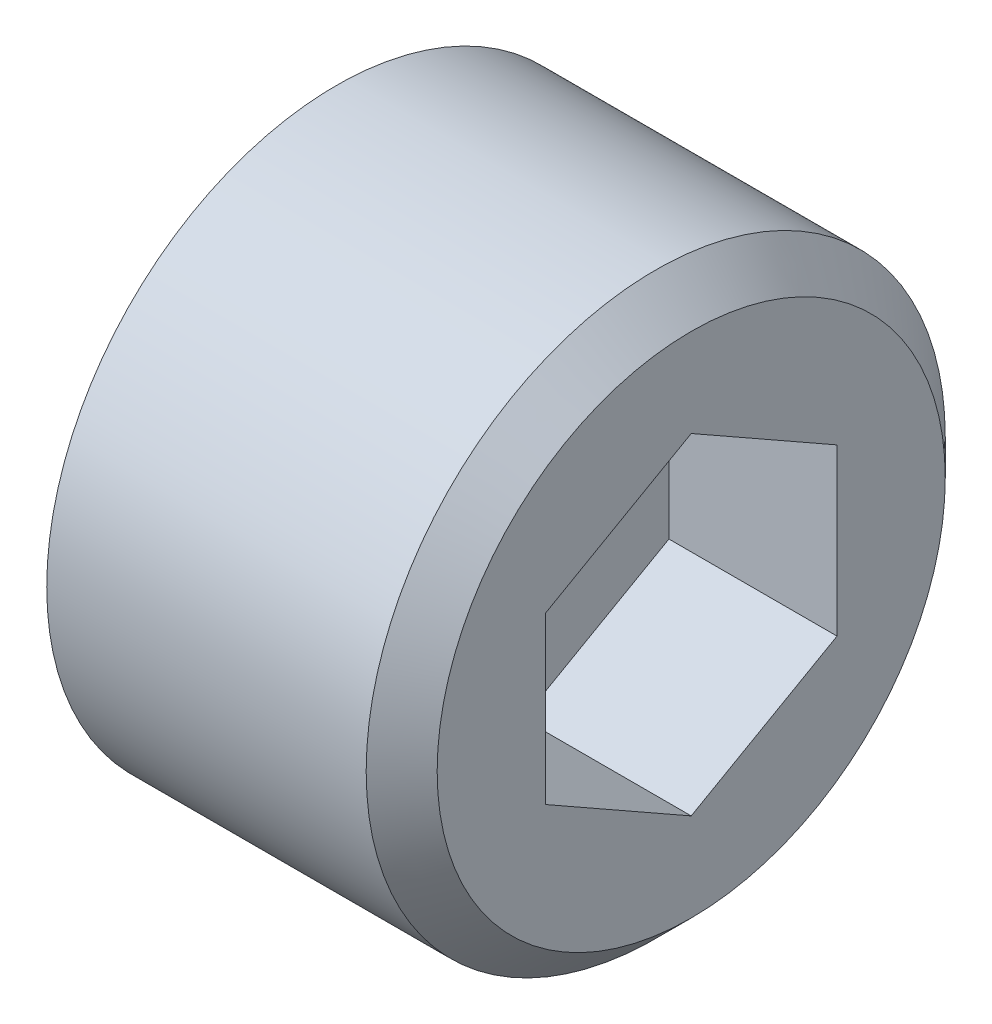
ISO-10303-21;
HEADER;
FILE_DESCRIPTION(('STEP AP214'),'2;1');
FILE_NAME('part.step','',(''),(''),'','','');
FILE_SCHEMA(('AUTOMOTIVE_DESIGN { 1 0 10303 214 1 1 1 1 }'));
ENDSEC;
DATA;
#1=APPLICATION_CONTEXT('core data for automotive mechanical design processes');
#2=APPLICATION_PROTOCOL_DEFINITION('international standard','automotive_design',2000,#1);
#3=PRODUCT_CONTEXT('',#1,'mechanical');
#4=PRODUCT('Part','Part','',(#3));
#5=PRODUCT_RELATED_PRODUCT_CATEGORY('part','',(#4));
#6=PRODUCT_DEFINITION_FORMATION('','',#4);
#7=PRODUCT_DEFINITION_CONTEXT('part definition',#1,'design');
#8=PRODUCT_DEFINITION('design','',#6,#7);
#9=PRODUCT_DEFINITION_SHAPE('','',#8);
#10=(LENGTH_UNIT() NAMED_UNIT(*) SI_UNIT(.MILLI.,.METRE.));
#11=(NAMED_UNIT(*) PLANE_ANGLE_UNIT() SI_UNIT($,.RADIAN.));
#12=(NAMED_UNIT(*) SI_UNIT($,.STERADIAN.) SOLID_ANGLE_UNIT());
#13=UNCERTAINTY_MEASURE_WITH_UNIT(LENGTH_MEASURE(1.E-05),#10,'distance_accuracy_value','');
#14=(GEOMETRIC_REPRESENTATION_CONTEXT(3) GLOBAL_UNCERTAINTY_ASSIGNED_CONTEXT((#13)) GLOBAL_UNIT_ASSIGNED_CONTEXT((#10,
#11,#12)) REPRESENTATION_CONTEXT('',''));
#15=CARTESIAN_POINT('',(0.,0.,0.));
#16=DIRECTION('',(0.,0.,1.));
#17=DIRECTION('',(1.,0.,0.));
#18=AXIS2_PLACEMENT_3D('',#15,#16,#17);
#19=CARTESIAN_POINT('',(698.265305948307,491.9201871,53.4669999999995));
#20=DIRECTION('',(1.,0.,0.));
#21=DIRECTION('',(0.,0.,-1.));
#22=AXIS2_PLACEMENT_3D('',#19,#20,#21);
#23=PLANE('',#22);
#24=DIRECTION('',(0.,0.493693899375207,0.869635747724128));
#25=VECTOR('',#24,1.);
#26=CARTESIAN_POINT('',(698.265305948307,493.045906050237,51.4840598780827));
#27=LINE('',#26,#25);
#28=CARTESIAN_POINT('',(698.265305948307,493.045906050237,51.4840598780827));
#29=VERTEX_POINT('',#28);
#30=CARTESIAN_POINT('',(698.265305948307,494.171625000473,53.4669999999994));
#31=VERTEX_POINT('',#30);
#32=EDGE_CURVE('E81',#29,#31,#27,.T.);
#33=ORIENTED_EDGE('',*,*,#32,.T.);
#34=DIRECTION('',(0.,-0.493693899375212,0.869635747724125));
#35=VECTOR('',#34,1.);
#36=CARTESIAN_POINT('',(698.265305948307,494.171625000473,53.4669999999995));
#37=LINE('',#36,#35);
#38=CARTESIAN_POINT('',(698.265305948307,493.045906050236,55.4499401219164));
#39=VERTEX_POINT('',#38);
#40=EDGE_CURVE('E65',#31,#39,#37,.T.);
#41=ORIENTED_EDGE('',*,*,#40,.T.);
#42=DIRECTION('',(0.,1.,0.));
#43=VECTOR('',#42,1.);
#44=CARTESIAN_POINT('',(698.265305948307,493.045906050237,55.4499401219165));
#45=LINE('',#44,#43);
#46=CARTESIAN_POINT('',(698.265305948307,490.794468149764,55.4499401219165));
#47=VERTEX_POINT('',#46);
#48=EDGE_CURVE('E70',#39,#47,#45,.F.);
#49=ORIENTED_EDGE('',*,*,#48,.T.);
#50=DIRECTION('',(0.,-0.493693899375212,-0.869635747724125));
#51=VECTOR('',#50,1.);
#52=CARTESIAN_POINT('',(698.265305948307,490.794468149764,55.4499401219165));
#53=LINE('',#52,#51);
#54=CARTESIAN_POINT('',(698.265305948307,489.668749199525,53.4669999999993));
#55=VERTEX_POINT('',#54);
#56=EDGE_CURVE('E104',#47,#55,#53,.T.);
#57=ORIENTED_EDGE('',*,*,#56,.T.);
#58=DIRECTION('',(0.,0.493693899375192,-0.869635747724136));
#59=VECTOR('',#58,1.);
#60=CARTESIAN_POINT('',(698.265305948307,489.668749199524,53.4669999999995));
#61=LINE('',#60,#59);
#62=CARTESIAN_POINT('',(698.265305948307,490.794468149763,51.4840598780825));
#63=VERTEX_POINT('',#62);
#64=EDGE_CURVE('E99',#55,#63,#61,.T.);
#65=ORIENTED_EDGE('',*,*,#64,.T.);
#66=DIRECTION('',(0.,1.,0.));
#67=VECTOR('',#66,1.);
#68=CARTESIAN_POINT('',(698.265305948307,490.794468149764,51.4840598780827));
#69=LINE('',#68,#67);
#70=EDGE_CURVE('E95',#63,#29,#69,.T.);
#71=ORIENTED_EDGE('',*,*,#70,.T.);
#72=EDGE_LOOP('',(#33,#41,#49,#57,#65,#71));
#73=FACE_BOUND('',#72,.T.);
#74=ADVANCED_FACE('F16',(#73),#23,.T.);
#75=CARTESIAN_POINT('',(700.551305948307,493.045906050237,55.4499401219165));
#76=DIRECTION('',(0.,0.,1.));
#77=DIRECTION('',(1.,0.,0.));
#78=AXIS2_PLACEMENT_3D('',#75,#76,#77);
#79=PLANE('',#78);
#80=DIRECTION('',(1.,0.,0.));
#81=VECTOR('',#80,1.);
#82=CARTESIAN_POINT('',(700.551305948307,493.045906050236,55.4499401219162));
#83=LINE('',#82,#81);
#84=CARTESIAN_POINT('',(700.551305948307,493.045906050236,55.4499401219164));
#85=VERTEX_POINT('',#84);
#86=EDGE_CURVE('E72',#39,#85,#83,.T.);
#87=ORIENTED_EDGE('',*,*,#86,.T.);
#88=DIRECTION('',(0.,1.,0.));
#89=VECTOR('',#88,1.);
#90=CARTESIAN_POINT('',(700.551305948307,491.9201871,55.4499401219165));
#91=LINE('',#90,#89);
#92=CARTESIAN_POINT('',(700.551305948307,490.794468149764,55.4499401219165));
#93=VERTEX_POINT('',#92);
#94=EDGE_CURVE('E106',#93,#85,#91,.T.);
#95=ORIENTED_EDGE('',*,*,#94,.F.);
#96=DIRECTION('',(1.,0.,0.));
#97=VECTOR('',#96,1.);
#98=CARTESIAN_POINT('',(700.551305948307,490.794468149764,55.4499401219165));
#99=LINE('',#98,#97);
#100=EDGE_CURVE('E75',#93,#47,#99,.F.);
#101=ORIENTED_EDGE('',*,*,#100,.T.);
#102=ORIENTED_EDGE('',*,*,#48,.F.);
#103=EDGE_LOOP('',(#87,#95,#101,#102));
#104=FACE_BOUND('',#103,.T.);
#105=ADVANCED_FACE('F71',(#104),#79,.F.);
#106=CARTESIAN_POINT('',(700.551305948307,494.171625000473,53.4669999999995));
#107=DIRECTION('',(0.,0.869635747724125,0.493693899375212));
#108=DIRECTION('',(0.,-0.493693899375212,0.869635747724125));
#109=AXIS2_PLACEMENT_3D('',#106,#107,#108);
#110=PLANE('',#109);
#111=DIRECTION('',(1.,0.,0.));
#112=VECTOR('',#111,1.);
#113=CARTESIAN_POINT('',(700.551305948307,494.171625000474,53.4669999999993));
#114=LINE('',#113,#112);
#115=CARTESIAN_POINT('',(700.551305948307,494.171625000473,53.4669999999994));
#116=VERTEX_POINT('',#115);
#117=EDGE_CURVE('E83',#31,#116,#114,.T.);
#118=ORIENTED_EDGE('',*,*,#117,.T.);
#119=DIRECTION('',(0.,0.49369389937499,-0.869635747724251));
#120=VECTOR('',#119,1.);
#121=CARTESIAN_POINT('',(700.551305948307,493.045906050237,55.4499401219165));
#122=LINE('',#121,#120);
#123=EDGE_CURVE('E87',#85,#116,#122,.T.);
#124=ORIENTED_EDGE('',*,*,#123,.F.);
#125=ORIENTED_EDGE('',*,*,#86,.F.);
#126=ORIENTED_EDGE('',*,*,#40,.F.);
#127=EDGE_LOOP('',(#118,#124,#125,#126));
#128=FACE_BOUND('',#127,.T.);
#129=ADVANCED_FACE('F85',(#128),#110,.F.);
#130=CARTESIAN_POINT('',(700.551305948307,493.045906050237,51.4840598780827));
#131=DIRECTION('',(0.,0.869635747724128,-0.493693899375207));
#132=DIRECTION('',(0.,0.493693899375207,0.869635747724128));
#133=AXIS2_PLACEMENT_3D('',#130,#131,#132);
#134=PLANE('',#133);
#135=DIRECTION('',(-1.,0.,0.));
#136=VECTOR('',#135,1.);
#137=CARTESIAN_POINT('',(700.551305948307,493.045906050237,51.4840598780827));
#138=LINE('',#137,#136);
#139=CARTESIAN_POINT('',(700.551305948307,493.045906050237,51.4840598780827));
#140=VERTEX_POINT('',#139);
#141=EDGE_CURVE('E93',#29,#140,#138,.F.);
#142=ORIENTED_EDGE('',*,*,#141,.T.);
#143=DIRECTION('',(0.,-0.493693899375037,-0.869635747724224));
#144=VECTOR('',#143,1.);
#145=CARTESIAN_POINT('',(700.551305948307,494.171625000473,53.4669999999995));
#146=LINE('',#145,#144);
#147=EDGE_CURVE('E109',#116,#140,#146,.T.);
#148=ORIENTED_EDGE('',*,*,#147,.F.);
#149=ORIENTED_EDGE('',*,*,#117,.F.);
#150=ORIENTED_EDGE('',*,*,#32,.F.);
#151=EDGE_LOOP('',(#142,#148,#149,#150));
#152=FACE_BOUND('',#151,.T.);
#153=ADVANCED_FACE('F191',(#152),#134,.F.);
#154=CARTESIAN_POINT('',(700.551305948307,490.794468149764,51.4840598780827));
#155=DIRECTION('',(0.,0.,-1.));
#156=DIRECTION('',(-1.,0.,0.));
#157=AXIS2_PLACEMENT_3D('',#154,#155,#156);
#158=PLANE('',#157);
#159=DIRECTION('',(1.,0.,0.));
#160=VECTOR('',#159,1.);
#161=CARTESIAN_POINT('',(700.551305948307,490.794468149762,51.4840598780819));
#162=LINE('',#161,#160);
#163=CARTESIAN_POINT('',(700.551305948307,490.794468149763,51.4840598780825));
#164=VERTEX_POINT('',#163);
#165=EDGE_CURVE('E97',#63,#164,#162,.T.);
#166=ORIENTED_EDGE('',*,*,#165,.T.);
#167=DIRECTION('',(0.,1.,0.));
#168=VECTOR('',#167,1.);
#169=CARTESIAN_POINT('',(700.551305948307,491.9201871,51.4840598780827));
#170=LINE('',#169,#168);
#171=EDGE_CURVE('E112',#140,#164,#170,.F.);
#172=ORIENTED_EDGE('',*,*,#171,.F.);
#173=ORIENTED_EDGE('',*,*,#141,.F.);
#174=ORIENTED_EDGE('',*,*,#70,.F.);
#175=EDGE_LOOP('',(#166,#172,#173,#174));
#176=FACE_BOUND('',#175,.T.);
#177=ADVANCED_FACE('F138',(#176),#158,.F.);
#178=CARTESIAN_POINT('',(700.551305948307,489.668749199524,53.4669999999995));
#179=DIRECTION('',(0.,-0.869635747724136,-0.493693899375192));
#180=DIRECTION('',(0.,0.493693899375192,-0.869635747724136));
#181=AXIS2_PLACEMENT_3D('',#178,#179,#180);
#182=PLANE('',#181);
#183=DIRECTION('',(1.,0.,0.));
#184=VECTOR('',#183,1.);
#185=CARTESIAN_POINT('',(700.551305948307,489.668749199526,53.4669999999987));
#186=LINE('',#185,#184);
#187=CARTESIAN_POINT('',(700.551305948307,489.668749199525,53.4669999999993));
#188=VERTEX_POINT('',#187);
#189=EDGE_CURVE('E33',#55,#188,#186,.T.);
#190=ORIENTED_EDGE('',*,*,#189,.T.);
#191=DIRECTION('',(0.,-0.493693899375865,0.869635747723754));
#192=VECTOR('',#191,1.);
#193=CARTESIAN_POINT('',(700.551305948307,490.794468149764,51.4840598780827));
#194=LINE('',#193,#192);
#195=EDGE_CURVE('E115',#164,#188,#194,.T.);
#196=ORIENTED_EDGE('',*,*,#195,.F.);
#197=ORIENTED_EDGE('',*,*,#165,.F.);
#198=ORIENTED_EDGE('',*,*,#64,.F.);
#199=EDGE_LOOP('',(#190,#196,#197,#198));
#200=FACE_BOUND('',#199,.T.);
#201=ADVANCED_FACE('F136',(#200),#182,.F.);
#202=CARTESIAN_POINT('',(700.551305948307,490.794468149764,55.4499401219165));
#203=DIRECTION('',(0.,-0.869635747724125,0.493693899375212));
#204=DIRECTION('',(0.,-0.493693899375212,-0.869635747724125));
#205=AXIS2_PLACEMENT_3D('',#202,#203,#204);
#206=PLANE('',#205);
#207=ORIENTED_EDGE('',*,*,#100,.F.);
#208=DIRECTION('',(0.,0.493693899375818,0.869635747723781));
#209=VECTOR('',#208,1.);
#210=CARTESIAN_POINT('',(700.551305948307,489.668749199524,53.4669999999995));
#211=LINE('',#210,#209);
#212=EDGE_CURVE('E118',#188,#93,#211,.T.);
#213=ORIENTED_EDGE('',*,*,#212,.F.);
#214=ORIENTED_EDGE('',*,*,#189,.F.);
#215=ORIENTED_EDGE('',*,*,#56,.F.);
#216=EDGE_LOOP('',(#207,#213,#214,#215));
#217=FACE_BOUND('',#216,.T.);
#218=ADVANCED_FACE('F132',(#217),#206,.F.);
#219=CARTESIAN_POINT('',(700.551305948307,491.9201871,53.4669999999995));
#220=DIRECTION('',(1.,0.,0.));
#221=DIRECTION('',(0.,0.,-1.));
#222=AXIS2_PLACEMENT_3D('',#219,#220,#221);
#223=PLANE('',#222);
#224=CARTESIAN_POINT('',(700.551305948295,491.9201871,53.4669999999995));
#225=DIRECTION('',(-1.,0.,0.));
#226=DIRECTION('',(0.,0.,1.));
#227=AXIS2_PLACEMENT_3D('',#224,#225,#226);
#228=CIRCLE('',#227,3.45440000001696);
#229=CARTESIAN_POINT('',(700.551305948295,491.9201871,56.9214000000164));
#230=VERTEX_POINT('',#229);
#231=EDGE_CURVE('E19',#230,#230,#228,.T.);
#232=ORIENTED_EDGE('',*,*,#231,.F.);
#233=EDGE_LOOP('',(#232));
#234=FACE_BOUND('',#233,.T.);
#235=ORIENTED_EDGE('',*,*,#195,.T.);
#236=ORIENTED_EDGE('',*,*,#212,.T.);
#237=ORIENTED_EDGE('',*,*,#94,.T.);
#238=ORIENTED_EDGE('',*,*,#123,.T.);
#239=ORIENTED_EDGE('',*,*,#147,.T.);
#240=ORIENTED_EDGE('',*,*,#171,.T.);
#241=EDGE_LOOP('',(#235,#236,#237,#238,#239,#240));
#242=FACE_BOUND('',#241,.T.);
#243=ADVANCED_FACE('F129',(#234,#242),#223,.T.);
#244=CARTESIAN_POINT('',(700.068705948411,491.9201871,53.4669999999995));
#245=DIRECTION('',(-1.,0.,0.));
#246=DIRECTION('',(0.,0.,1.));
#247=AXIS2_PLACEMENT_3D('',#244,#245,#246);
#248=CONICAL_SURFACE('',#247,3.93699999990127,0.785398163397448);
#249=CARTESIAN_POINT('',(700.068705948307,491.9201871,53.4669999999995));
#250=DIRECTION('',(1.,0.,0.));
#251=DIRECTION('',(0.,0.,-1.));
#252=AXIS2_PLACEMENT_3D('',#249,#250,#251);
#253=CIRCLE('',#252,3.937);
#254=CARTESIAN_POINT('',(700.068705948307,491.9201871,49.5299999999995));
#255=VERTEX_POINT('',#254);
#256=EDGE_CURVE('E25',#255,#255,#253,.F.);
#257=ORIENTED_EDGE('',*,*,#256,.F.);
#258=EDGE_LOOP('',(#257));
#259=FACE_BOUND('',#258,.T.);
#260=ORIENTED_EDGE('',*,*,#231,.T.);
#261=EDGE_LOOP('',(#260));
#262=FACE_BOUND('',#261,.T.);
#263=ADVANCED_FACE('F127',(#259,#262),#248,.T.);
#264=CARTESIAN_POINT('',(695.725305948307,491.9201871,53.4669999999995));
#265=DIRECTION('',(1.,0.,0.));
#266=DIRECTION('',(0.,0.,-1.));
#267=AXIS2_PLACEMENT_3D('',#264,#265,#266);
#268=PLANE('',#267);
#269=CARTESIAN_POINT('',(695.725305948307,491.9201871,53.4669999999995));
#270=DIRECTION('',(1.,0.,0.));
#271=DIRECTION('',(0.,0.,-1.));
#272=AXIS2_PLACEMENT_3D('',#269,#270,#271);
#273=CIRCLE('',#272,3.937);
#274=CARTESIAN_POINT('',(695.725305948307,491.9201871,49.5299999999995));
#275=VERTEX_POINT('',#274);
#276=EDGE_CURVE('E11',#275,#275,#273,.T.);
#277=ORIENTED_EDGE('',*,*,#276,.F.);
#278=EDGE_LOOP('',(#277));
#279=FACE_BOUND('',#278,.T.);
#280=ADVANCED_FACE('F150',(#279),#268,.F.);
#281=CARTESIAN_POINT('',(700.551305948307,491.9201871,53.4669999999995));
#282=DIRECTION('',(1.,0.,0.));
#283=DIRECTION('',(0.,0.,-1.));
#284=AXIS2_PLACEMENT_3D('',#281,#282,#283);
#285=CYLINDRICAL_SURFACE('',#284,3.937);
#286=ORIENTED_EDGE('',*,*,#256,.T.);
#287=EDGE_LOOP('',(#286));
#288=FACE_BOUND('',#287,.T.);
#289=ORIENTED_EDGE('',*,*,#276,.T.);
#290=EDGE_LOOP('',(#289));
#291=FACE_BOUND('',#290,.T.);
#292=ADVANCED_FACE('F148',(#288,#291),#285,.T.);
#293=CLOSED_SHELL('',(#74,#105,#129,#153,#177,#201,#218,#243,#263,#280,#292));
#294=MANIFOLD_SOLID_BREP('B1',#293);
#295=ADVANCED_BREP_SHAPE_REPRESENTATION('',(#18,#294),#14);
#296=SHAPE_DEFINITION_REPRESENTATION(#9,#295);
ENDSEC;
END-ISO-10303-21;
